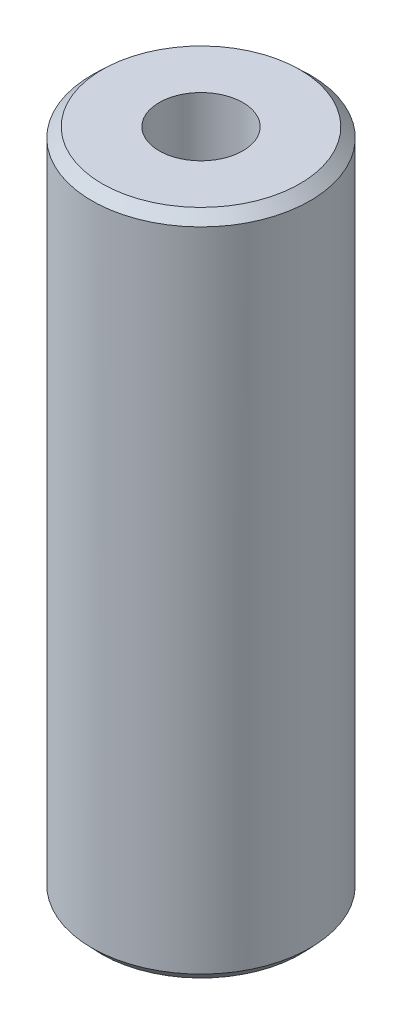
ISO-10303-21;
HEADER;
FILE_DESCRIPTION(('STEP AP214'),'2;1');
FILE_NAME('part.step','',(''),(''),'','','');
FILE_SCHEMA(('AUTOMOTIVE_DESIGN { 1 0 10303 214 1 1 1 1 }'));
ENDSEC;
DATA;
#1=APPLICATION_CONTEXT('core data for automotive mechanical design processes');
#2=APPLICATION_PROTOCOL_DEFINITION('international standard','automotive_design',2000,#1);
#3=PRODUCT_CONTEXT('',#1,'mechanical');
#4=PRODUCT('Part','Part','',(#3));
#5=PRODUCT_RELATED_PRODUCT_CATEGORY('part','',(#4));
#6=PRODUCT_DEFINITION_FORMATION('','',#4);
#7=PRODUCT_DEFINITION_CONTEXT('part definition',#1,'design');
#8=PRODUCT_DEFINITION('design','',#6,#7);
#9=PRODUCT_DEFINITION_SHAPE('','',#8);
#10=(LENGTH_UNIT() NAMED_UNIT(*) SI_UNIT(.MILLI.,.METRE.));
#11=(NAMED_UNIT(*) PLANE_ANGLE_UNIT() SI_UNIT($,.RADIAN.));
#12=(NAMED_UNIT(*) SI_UNIT($,.STERADIAN.) SOLID_ANGLE_UNIT());
#13=UNCERTAINTY_MEASURE_WITH_UNIT(LENGTH_MEASURE(1.E-05),#10,'distance_accuracy_value','');
#14=(GEOMETRIC_REPRESENTATION_CONTEXT(3) GLOBAL_UNCERTAINTY_ASSIGNED_CONTEXT((#13)) GLOBAL_UNIT_ASSIGNED_CONTEXT((#10,
#11,#12)) REPRESENTATION_CONTEXT('',''));
#15=CARTESIAN_POINT('',(0.,0.,0.));
#16=DIRECTION('',(0.,0.,1.));
#17=DIRECTION('',(1.,0.,0.));
#18=AXIS2_PLACEMENT_3D('',#15,#16,#17);
#19=CARTESIAN_POINT('',(0.,229.29587864807,0.));
#20=DIRECTION('',(0.,-1.,0.));
#21=DIRECTION('',(0.,0.,-1.));
#22=AXIS2_PLACEMENT_3D('',#19,#20,#21);
#23=CYLINDRICAL_SURFACE('',#22,37.5);
#24=CARTESIAN_POINT('',(0.,225.967313645961,0.));
#25=DIRECTION('',(0.,1.,0.));
#26=DIRECTION('',(0.,0.,1.));
#27=AXIS2_PLACEMENT_3D('',#24,#25,#26);
#28=CIRCLE('',#27,37.5);
#29=CARTESIAN_POINT('',(0.,225.967313645961,-37.5));
#30=VERTEX_POINT('',#29);
#31=EDGE_CURVE('E50',#30,#30,#28,.F.);
#32=CARTESIAN_POINT('',(0.,3.51280503069826,0.));
#33=DIRECTION('',(0.,1.,0.));
#34=DIRECTION('',(0.,0.,1.));
#35=AXIS2_PLACEMENT_3D('',#32,#33,#34);
#36=CIRCLE('',#35,37.5);
#37=CARTESIAN_POINT('',(0.,3.51280503069823,-37.5));
#38=VERTEX_POINT('',#37);
#39=EDGE_CURVE('E51',#38,#38,#36,.T.);
#40=CARTESIAN_POINT('',(0.,225.967313645961,-37.5));
#41=CARTESIAN_POINT('',(0.,223.650079181218,-37.5));
#42=CARTESIAN_POINT('',(0.,221.332844716476,-37.5));
#43=CARTESIAN_POINT('',(0.,216.698375786991,-37.5));
#44=CARTESIAN_POINT('',(0.,214.381141322249,-37.5));
#45=CARTESIAN_POINT('',(0.,209.746672392764,-37.5));
#46=CARTESIAN_POINT('',(0.,207.429437928022,-37.5));
#47=CARTESIAN_POINT('',(0.,202.794968998537,-37.5));
#48=CARTESIAN_POINT('',(0.,200.477734533795,-37.5));
#49=CARTESIAN_POINT('',(0.,195.843265604311,-37.5));
#50=CARTESIAN_POINT('',(0.,193.526031139568,-37.5));
#51=CARTESIAN_POINT('',(0.,188.891562210084,-37.5));
#52=CARTESIAN_POINT('',(0.,186.574327745341,-37.5));
#53=CARTESIAN_POINT('',(0.,181.939858815857,-37.5));
#54=CARTESIAN_POINT('',(0.,179.622624351114,-37.5));
#55=CARTESIAN_POINT('',(0.,174.98815542163,-37.5));
#56=CARTESIAN_POINT('',(0.,172.670920956887,-37.5));
#57=CARTESIAN_POINT('',(0.,168.036452027403,-37.5));
#58=CARTESIAN_POINT('',(0.,165.71921756266,-37.5));
#59=CARTESIAN_POINT('',(0.,161.084748633176,-37.5));
#60=CARTESIAN_POINT('',(0.,158.767514168433,-37.5));
#61=CARTESIAN_POINT('',(0.,154.133045238949,-37.5));
#62=CARTESIAN_POINT('',(0.,151.815810774207,-37.5));
#63=CARTESIAN_POINT('',(0.,147.181341844722,-37.5));
#64=CARTESIAN_POINT('',(0.,144.86410737998,-37.5));
#65=CARTESIAN_POINT('',(0.,140.229638450495,-37.5));
#66=CARTESIAN_POINT('',(0.,137.912403985753,-37.5));
#67=CARTESIAN_POINT('',(0.,133.277935056268,-37.5));
#68=CARTESIAN_POINT('',(0.,130.960700591526,-37.5));
#69=CARTESIAN_POINT('',(0.,126.326231662041,-37.5));
#70=CARTESIAN_POINT('',(0.,124.008997197299,-37.5));
#71=CARTESIAN_POINT('',(0.,119.374528267814,-37.5));
#72=CARTESIAN_POINT('',(0.,117.057293803072,-37.5));
#73=CARTESIAN_POINT('',(0.,112.422824873587,-37.5));
#74=CARTESIAN_POINT('',(0.,110.105590408845,-37.5));
#75=CARTESIAN_POINT('',(0.,105.47112147936,-37.5));
#76=CARTESIAN_POINT('',(0.,103.153887014618,-37.5));
#77=CARTESIAN_POINT('',(0.,98.5194180851332,-37.5));
#78=CARTESIAN_POINT('',(0.,96.2021836203909,-37.5));
#79=CARTESIAN_POINT('',(0.,91.5677146909063,-37.5));
#80=CARTESIAN_POINT('',(0.,89.250480226164,-37.5));
#81=CARTESIAN_POINT('',(0.,84.6160112966793,-37.5));
#82=CARTESIAN_POINT('',(0.,82.298776831937,-37.5));
#83=CARTESIAN_POINT('',(0.,77.6643079024524,-37.5));
#84=CARTESIAN_POINT('',(0.,75.34707343771,-37.5));
#85=CARTESIAN_POINT('',(0.,70.7126045082254,-37.5));
#86=CARTESIAN_POINT('',(0.,68.3953700434831,-37.5));
#87=CARTESIAN_POINT('',(0.,63.7609011139985,-37.5));
#88=CARTESIAN_POINT('',(0.,61.4436666492562,-37.5));
#89=CARTESIAN_POINT('',(0.,56.8091977197715,-37.5));
#90=CARTESIAN_POINT('',(0.,54.4919632550292,-37.5));
#91=CARTESIAN_POINT('',(0.,49.8574943255446,-37.5));
#92=CARTESIAN_POINT('',(0.,47.5402598608022,-37.5));
#93=CARTESIAN_POINT('',(0.,42.9057909313176,-37.5));
#94=CARTESIAN_POINT('',(0.,40.5885564665753,-37.5));
#95=CARTESIAN_POINT('',(0.,35.9540875370907,-37.5));
#96=CARTESIAN_POINT('',(0.,33.6368530723483,-37.5));
#97=CARTESIAN_POINT('',(0.,29.0023841428637,-37.5));
#98=CARTESIAN_POINT('',(0.,26.6851496781214,-37.5));
#99=CARTESIAN_POINT('',(0.,22.0506807486368,-37.5));
#100=CARTESIAN_POINT('',(0.,19.7334462838944,-37.5));
#101=CARTESIAN_POINT('',(0.,15.0989773544098,-37.5));
#102=CARTESIAN_POINT('',(0.,12.7817428896675,-37.5));
#103=CARTESIAN_POINT('',(0.,8.14727396018287,-37.5));
#104=CARTESIAN_POINT('',(0.,5.83003949544055,-37.5));
#105=CARTESIAN_POINT('',(0.,3.51280503069823,-37.5));
#106=B_SPLINE_CURVE_WITH_KNOTS('',3,(#40,#41,#42,#43,#44,#45,#46,#47,#48,#49,#50,#51,#52,#53,
#54,#55,#56,#57,#58,#59,#60,#61,#62,#63,#64,#65,#66,#67,#68,#69,#70,#71,#72,#73,#74,#75,#76,#77,
#78,#79,#80,#81,#82,#83,#84,#85,#86,#87,#88,#89,#90,#91,#92,#93,#94,#95,#96,#97,#98,#99,#100,
#101,#102,#103,#104,#105),.UNSPECIFIED.,.F.,.F.,(4,2,2,2,2,2,2,2,2,2,2,2,2,2,2,2,2,2,2,2,2,2,2,
2,2,2,2,2,2,2,2,2,4),(0.,6.95170339422693,13.9034067884539,20.8551101826808,27.8068135769078,
34.7585169711347,41.7102203653617,48.6619237595886,55.6136271538156,62.5653305480425,
69.5170339422695,76.4687373364964,83.4204407307234,90.3721441249503,97.3238475191773,
104.275550913404,111.227254307631,118.178957701858,125.130661096085,132.082364490312,
139.034067884539,145.985771278766,152.937474672993,159.88917806722,166.840881461447,
173.792584855674,180.744288249901,187.695991644128,194.647695038355,201.599398432582,
208.551101826808,215.502805221035,222.454508615262),.UNSPECIFIED.);
#107=EDGE_CURVE('BSEAM39',#30,#38,#106,.T.);
#108=ORIENTED_EDGE('',*,*,#31,.T.);
#109=ORIENTED_EDGE('',*,*,#39,.T.);
#110=ORIENTED_EDGE('',*,*,#107,.T.);
#111=ORIENTED_EDGE('',*,*,#107,.F.);
#112=EDGE_LOOP('',(#108,#110,#109,#111));
#113=FACE_BOUND('',#112,.T.);
#114=ADVANCED_FACE('F39',(#113),#23,.T.);
#115=CARTESIAN_POINT('',(0.,229.29587864807,0.));
#116=DIRECTION('',(0.,1.,0.));
#117=DIRECTION('',(0.,0.,1.));
#118=AXIS2_PLACEMENT_3D('',#115,#116,#117);
#119=PLANE('',#118);
#120=CARTESIAN_POINT('',(0.,229.29587864807,0.));
#121=DIRECTION('',(0.,1.,0.));
#122=DIRECTION('',(0.,0.,1.));
#123=AXIS2_PLACEMENT_3D('',#120,#121,#122);
#124=CIRCLE('',#123,33.987194969302);
#125=CARTESIAN_POINT('',(0.,229.29587864807,33.987194969302));
#126=VERTEX_POINT('',#125);
#127=EDGE_CURVE('E54',#126,#126,#124,.T.);
#128=ORIENTED_EDGE('',*,*,#127,.T.);
#129=EDGE_LOOP('',(#128));
#130=FACE_BOUND('',#129,.T.);
#131=CARTESIAN_POINT('',(0.,229.29587864807,0.));
#132=DIRECTION('',(0.,1.,0.));
#133=DIRECTION('',(0.,0.,1.));
#134=AXIS2_PLACEMENT_3D('',#131,#132,#133);
#135=CIRCLE('',#134,14.3911335004637);
#136=CARTESIAN_POINT('',(0.,229.29587864807,-14.3911335004637));
#137=VERTEX_POINT('',#136);
#138=EDGE_CURVE('E58',#137,#137,#135,.T.);
#139=ORIENTED_EDGE('',*,*,#138,.F.);
#140=EDGE_LOOP('',(#139));
#141=FACE_BOUND('',#140,.T.);
#142=ADVANCED_FACE('F69',(#130,#141),#119,.T.);
#143=CARTESIAN_POINT('',(0.,0.,0.));
#144=DIRECTION('',(0.,1.,0.));
#145=DIRECTION('',(0.,0.,1.));
#146=AXIS2_PLACEMENT_3D('',#143,#144,#145);
#147=PLANE('',#146);
#148=CARTESIAN_POINT('',(0.,0.,0.));
#149=DIRECTION('',(0.,1.,0.));
#150=DIRECTION('',(0.,0.,1.));
#151=AXIS2_PLACEMENT_3D('',#148,#149,#150);
#152=CIRCLE('',#151,34.1714349978902);
#153=CARTESIAN_POINT('',(0.,0.,34.1714349978902));
#154=VERTEX_POINT('',#153);
#155=EDGE_CURVE('E10',#154,#154,#152,.F.);
#156=ORIENTED_EDGE('',*,*,#155,.T.);
#157=EDGE_LOOP('',(#156));
#158=FACE_BOUND('',#157,.T.);
#159=CARTESIAN_POINT('',(0.,0.,0.));
#160=DIRECTION('',(0.,1.,0.));
#161=DIRECTION('',(0.,0.,1.));
#162=AXIS2_PLACEMENT_3D('',#159,#160,#161);
#163=CIRCLE('',#162,14.3911335004637);
#164=CARTESIAN_POINT('',(0.,0.,-14.3911335004637));
#165=VERTEX_POINT('',#164);
#166=EDGE_CURVE('E63',#165,#165,#163,.T.);
#167=ORIENTED_EDGE('',*,*,#166,.T.);
#168=EDGE_LOOP('',(#167));
#169=FACE_BOUND('',#168,.T.);
#170=ADVANCED_FACE('F75',(#158,#169),#147,.F.);
#171=CARTESIAN_POINT('',(0.,229.29587864807,0.));
#172=DIRECTION('',(0.,-1.,0.));
#173=DIRECTION('',(0.,0.,-1.));
#174=AXIS2_PLACEMENT_3D('',#171,#172,#173);
#175=CYLINDRICAL_SURFACE('',#174,14.3911335004637);
#176=CARTESIAN_POINT('',(0.,229.29587864807,-14.3911335004637));
#177=CARTESIAN_POINT('',(0.,226.907379912153,-14.3911335004637));
#178=CARTESIAN_POINT('',(0.,224.518881176235,-14.3911335004637));
#179=CARTESIAN_POINT('',(0.,219.741883704401,-14.3911335004637));
#180=CARTESIAN_POINT('',(0.,217.353384968483,-14.3911335004637));
#181=CARTESIAN_POINT('',(0.,212.576387496648,-14.3911335004637));
#182=CARTESIAN_POINT('',(0.,210.187888760731,-14.3911335004637));
#183=CARTESIAN_POINT('',(0.,205.410891288896,-14.3911335004637));
#184=CARTESIAN_POINT('',(0.,203.022392552979,-14.3911335004637));
#185=CARTESIAN_POINT('',(0.,198.245395081144,-14.3911335004637));
#186=CARTESIAN_POINT('',(0.,195.856896345227,-14.3911335004637));
#187=CARTESIAN_POINT('',(0.,191.079898873392,-14.3911335004637));
#188=CARTESIAN_POINT('',(0.,188.691400137474,-14.3911335004637));
#189=CARTESIAN_POINT('',(0.,183.91440266564,-14.3911335004637));
#190=CARTESIAN_POINT('',(0.,181.525903929722,-14.3911335004637));
#191=CARTESIAN_POINT('',(0.,176.748906457887,-14.3911335004637));
#192=CARTESIAN_POINT('',(0.,174.36040772197,-14.3911335004637));
#193=CARTESIAN_POINT('',(0.,169.583410250135,-14.3911335004637));
#194=CARTESIAN_POINT('',(0.,167.194911514218,-14.3911335004637));
#195=CARTESIAN_POINT('',(0.,162.417914042383,-14.3911335004637));
#196=CARTESIAN_POINT('',(0.,160.029415306466,-14.3911335004637));
#197=CARTESIAN_POINT('',(0.,155.252417834631,-14.3911335004637));
#198=CARTESIAN_POINT('',(0.,152.863919098713,-14.3911335004637));
#199=CARTESIAN_POINT('',(0.,148.086921626879,-14.3911335004637));
#200=CARTESIAN_POINT('',(0.,145.698422890961,-14.3911335004637));
#201=CARTESIAN_POINT('',(0.,140.921425419126,-14.3911335004637));
#202=CARTESIAN_POINT('',(0.,138.532926683209,-14.3911335004637));
#203=CARTESIAN_POINT('',(0.,133.755929211374,-14.3911335004637));
#204=CARTESIAN_POINT('',(0.,131.367430475457,-14.3911335004637));
#205=CARTESIAN_POINT('',(0.,126.590433003622,-14.3911335004637));
#206=CARTESIAN_POINT('',(0.,124.201934267705,-14.3911335004637));
#207=CARTESIAN_POINT('',(0.,119.42493679587,-14.3911335004637));
#208=CARTESIAN_POINT('',(0.,117.036438059952,-14.3911335004637));
#209=CARTESIAN_POINT('',(0.,112.259440588118,-14.3911335004637));
#210=CARTESIAN_POINT('',(0.,109.8709418522,-14.3911335004637));
#211=CARTESIAN_POINT('',(0.,105.093944380365,-14.3911335004637));
#212=CARTESIAN_POINT('',(0.,102.705445644448,-14.3911335004637));
#213=CARTESIAN_POINT('',(0.,97.9284481726133,-14.3911335004637));
#214=CARTESIAN_POINT('',(0.,95.5399494366959,-14.3911335004637));
#215=CARTESIAN_POINT('',(0.,90.7629519648611,-14.3911335004637));
#216=CARTESIAN_POINT('',(0.,88.3744532289437,-14.3911335004637));
#217=CARTESIAN_POINT('',(0.,83.5974557571089,-14.3911335004637));
#218=CARTESIAN_POINT('',(0.,81.2089570211915,-14.3911335004637));
#219=CARTESIAN_POINT('',(0.,76.4319595493567,-14.3911335004637));
#220=CARTESIAN_POINT('',(0.,74.0434608134393,-14.3911335004637));
#221=CARTESIAN_POINT('',(0.,69.2664633416045,-14.3911335004637));
#222=CARTESIAN_POINT('',(0.,66.8779646056871,-14.3911335004637));
#223=CARTESIAN_POINT('',(0.,62.1009671338523,-14.3911335004637));
#224=CARTESIAN_POINT('',(0.,59.7124683979349,-14.3911335004637));
#225=CARTESIAN_POINT('',(0.,54.9354709261001,-14.3911335004637));
#226=CARTESIAN_POINT('',(0.,52.5469721901827,-14.3911335004637));
#227=CARTESIAN_POINT('',(0.,47.7699747183479,-14.3911335004637));
#228=CARTESIAN_POINT('',(0.,45.3814759824306,-14.3911335004637));
#229=CARTESIAN_POINT('',(0.,40.6044785105958,-14.3911335004637));
#230=CARTESIAN_POINT('',(0.,38.2159797746784,-14.3911335004637));
#231=CARTESIAN_POINT('',(0.,33.4389823028436,-14.3911335004637));
#232=CARTESIAN_POINT('',(0.,31.0504835669262,-14.3911335004637));
#233=CARTESIAN_POINT('',(0.,26.2734860950914,-14.3911335004637));
#234=CARTESIAN_POINT('',(0.,23.884987359174,-14.3911335004637));
#235=CARTESIAN_POINT('',(0.,19.1079898873392,-14.3911335004637));
#236=CARTESIAN_POINT('',(0.,16.7194911514218,-14.3911335004637));
#237=CARTESIAN_POINT('',(0.,11.942493679587,-14.3911335004637));
#238=CARTESIAN_POINT('',(0.,9.5539949436696,-14.3911335004637));
#239=CARTESIAN_POINT('',(0.,4.7769974718348,-14.3911335004637));
#240=CARTESIAN_POINT('',(0.,2.38849873591739,-14.3911335004637));
#241=CARTESIAN_POINT('',(0.,0.,-14.3911335004637));
#242=B_SPLINE_CURVE_WITH_KNOTS('',3,(#176,#177,#178,#179,#180,#181,#182,#183,#184,#185,#186,
#187,#188,#189,#190,#191,#192,#193,#194,#195,#196,#197,#198,#199,#200,#201,#202,#203,#204,#205,
#206,#207,#208,#209,#210,#211,#212,#213,#214,#215,#216,#217,#218,#219,#220,#221,#222,#223,#224,
#225,#226,#227,#228,#229,#230,#231,#232,#233,#234,#235,#236,#237,#238,#239,#240,#241),
.UNSPECIFIED.,.F.,.F.,(4,2,2,2,2,2,2,2,2,2,2,2,2,2,2,2,2,2,2,2,2,2,2,2,2,2,2,2,2,2,2,2,4),(0.,
7.16549620775217,14.3309924155044,21.4964886232566,28.6619848310087,35.8274810387609,
42.9929772465131,50.1584734542653,57.3239696620175,64.4894658697697,71.6549620775219,
78.8204582852741,85.9859544930263,93.1514507007785,100.316946908531,107.482443116283,
114.647939324035,121.813435531787,128.978931739539,136.144427947292,143.309924155044,
150.475420362796,157.640916570548,164.8064127783,171.971908986053,179.137405193805,
186.302901401557,193.468397609309,200.633893817061,207.799390024814,214.964886232566,
222.130382440318,229.29587864807),.UNSPECIFIED.);
#243=EDGE_CURVE('BSEAM70',#137,#165,#242,.T.);
#244=ORIENTED_EDGE('',*,*,#138,.T.);
#245=ORIENTED_EDGE('',*,*,#166,.F.);
#246=ORIENTED_EDGE('',*,*,#243,.T.);
#247=ORIENTED_EDGE('',*,*,#243,.F.);
#248=EDGE_LOOP('',(#244,#246,#245,#247));
#249=FACE_BOUND('',#248,.T.);
#250=ADVANCED_FACE('F70',(#249),#175,.F.);
#251=CARTESIAN_POINT('',(0.,229.29587864807,0.));
#252=DIRECTION('',(0.,-1.,0.));
#253=DIRECTION('',(0.,0.,-1.));
#254=AXIS2_PLACEMENT_3D('',#251,#252,#253);
#255=CONICAL_SURFACE('',#254,33.987194969302,0.812321938555916);
#256=ORIENTED_EDGE('',*,*,#31,.F.);
#257=EDGE_LOOP('',(#256));
#258=FACE_BOUND('',#257,.T.);
#259=ORIENTED_EDGE('',*,*,#127,.F.);
#260=EDGE_LOOP('',(#259));
#261=FACE_BOUND('',#260,.T.);
#262=ADVANCED_FACE('F81',(#258,#261),#255,.T.);
#263=CARTESIAN_POINT('',(0.,3.51280503069826,0.));
#264=DIRECTION('',(0.,1.,0.));
#265=DIRECTION('',(0.,0.,1.));
#266=AXIS2_PLACEMENT_3D('',#263,#264,#265);
#267=CONICAL_SURFACE('',#266,37.5,0.758474388238989);
#268=ORIENTED_EDGE('',*,*,#155,.F.);
#269=EDGE_LOOP('',(#268));
#270=FACE_BOUND('',#269,.T.);
#271=ORIENTED_EDGE('',*,*,#39,.F.);
#272=EDGE_LOOP('',(#271));
#273=FACE_BOUND('',#272,.T.);
#274=ADVANCED_FACE('F45',(#270,#273),#267,.T.);
#275=CLOSED_SHELL('',(#114,#142,#170,#250,#262,#274));
#276=MANIFOLD_SOLID_BREP('B2',#275);
#277=ADVANCED_BREP_SHAPE_REPRESENTATION('',(#18,#276),#14);
#278=SHAPE_DEFINITION_REPRESENTATION(#9,#277);
ENDSEC;
END-ISO-10303-21;
